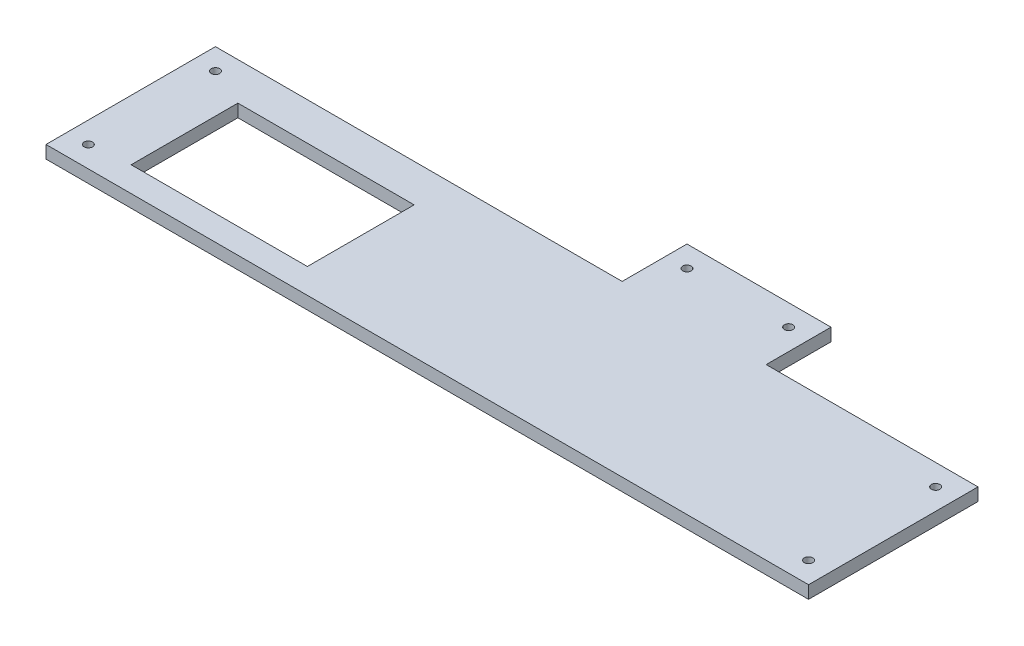
ISO-10303-21;
HEADER;
FILE_DESCRIPTION(('STEP AP214'),'2;1');
FILE_NAME('part.step','',(''),(''),'','','');
FILE_SCHEMA(('AUTOMOTIVE_DESIGN { 1 0 10303 214 1 1 1 1 }'));
ENDSEC;
DATA;
#1=APPLICATION_CONTEXT('core data for automotive mechanical design processes');
#2=APPLICATION_PROTOCOL_DEFINITION('international standard','automotive_design',2000,#1);
#3=PRODUCT_CONTEXT('',#1,'mechanical');
#4=PRODUCT('Part','Part','',(#3));
#5=PRODUCT_RELATED_PRODUCT_CATEGORY('part','',(#4));
#6=PRODUCT_DEFINITION_FORMATION('','',#4);
#7=PRODUCT_DEFINITION_CONTEXT('part definition',#1,'design');
#8=PRODUCT_DEFINITION('design','',#6,#7);
#9=PRODUCT_DEFINITION_SHAPE('','',#8);
#10=(LENGTH_UNIT() NAMED_UNIT(*) SI_UNIT(.MILLI.,.METRE.));
#11=(NAMED_UNIT(*) PLANE_ANGLE_UNIT() SI_UNIT($,.RADIAN.));
#12=(NAMED_UNIT(*) SI_UNIT($,.STERADIAN.) SOLID_ANGLE_UNIT());
#13=UNCERTAINTY_MEASURE_WITH_UNIT(LENGTH_MEASURE(1.E-05),#10,'distance_accuracy_value','');
#14=(GEOMETRIC_REPRESENTATION_CONTEXT(3) GLOBAL_UNCERTAINTY_ASSIGNED_CONTEXT((#13)) GLOBAL_UNIT_ASSIGNED_CONTEXT((#10,
#11,#12)) REPRESENTATION_CONTEXT('',''));
#15=CARTESIAN_POINT('',(0.,0.,0.));
#16=DIRECTION('',(0.,0.,1.));
#17=DIRECTION('',(1.,0.,0.));
#18=AXIS2_PLACEMENT_3D('',#15,#16,#17);
#19=CARTESIAN_POINT('',(450.,-15.,-100.000000000001));
#20=DIRECTION('',(0.,0.,-1.));
#21=DIRECTION('',(-1.,0.,0.));
#22=AXIS2_PLACEMENT_3D('',#19,#20,#21);
#23=PLANE('',#22);
#24=DIRECTION('',(-1.,0.,0.));
#25=VECTOR('',#24,1.);
#26=CARTESIAN_POINT('',(450.,-15.,-100.000000000001));
#27=LINE('',#26,#25);
#28=CARTESIAN_POINT('',(450.,-15.,-100.000000000001));
#29=VERTEX_POINT('',#28);
#30=CARTESIAN_POINT('',(200.,-15.,-100.000000000001));
#31=VERTEX_POINT('',#30);
#32=EDGE_CURVE('E223',#29,#31,#27,.T.);
#33=ORIENTED_EDGE('',*,*,#32,.T.);
#34=DIRECTION('',(0.,1.,0.));
#35=VECTOR('',#34,1.);
#36=CARTESIAN_POINT('',(200.,-15.,-100.000000000001));
#37=LINE('',#36,#35);
#38=CARTESIAN_POINT('',(200.,0.,-100.000000000001));
#39=VERTEX_POINT('',#38);
#40=EDGE_CURVE('E146',#31,#39,#37,.T.);
#41=ORIENTED_EDGE('',*,*,#40,.T.);
#42=DIRECTION('',(-1.,0.,0.));
#43=VECTOR('',#42,1.);
#44=CARTESIAN_POINT('',(450.,0.,-100.000000000001));
#45=LINE('',#44,#43);
#46=CARTESIAN_POINT('',(450.,0.,-100.000000000001));
#47=VERTEX_POINT('',#46);
#48=EDGE_CURVE('E234',#47,#39,#45,.T.);
#49=ORIENTED_EDGE('',*,*,#48,.F.);
#50=DIRECTION('',(0.,1.,0.));
#51=VECTOR('',#50,1.);
#52=CARTESIAN_POINT('',(450.,-15.,-100.000000000001));
#53=LINE('',#52,#51);
#54=EDGE_CURVE('E38',#29,#47,#53,.T.);
#55=ORIENTED_EDGE('',*,*,#54,.F.);
#56=EDGE_LOOP('',(#33,#41,#49,#55));
#57=FACE_BOUND('',#56,.T.);
#58=ADVANCED_FACE('F34',(#57),#23,.T.);
#59=CARTESIAN_POINT('',(450.,-15.,100.000000000001));
#60=DIRECTION('',(1.,0.,0.));
#61=DIRECTION('',(0.,0.,-1.));
#62=AXIS2_PLACEMENT_3D('',#59,#60,#61);
#63=PLANE('',#62);
#64=DIRECTION('',(0.,0.,-1.));
#65=VECTOR('',#64,1.);
#66=CARTESIAN_POINT('',(450.,0.,100.000000000001));
#67=LINE('',#66,#65);
#68=CARTESIAN_POINT('',(450.,0.,100.000000000001));
#69=VERTEX_POINT('',#68);
#70=EDGE_CURVE('E215',#69,#47,#67,.T.);
#71=ORIENTED_EDGE('',*,*,#70,.F.);
#72=DIRECTION('',(0.,1.,0.));
#73=VECTOR('',#72,1.);
#74=CARTESIAN_POINT('',(450.,-15.,100.000000000001));
#75=LINE('',#74,#73);
#76=CARTESIAN_POINT('',(450.,-15.,100.000000000001));
#77=VERTEX_POINT('',#76);
#78=EDGE_CURVE('E11',#77,#69,#75,.T.);
#79=ORIENTED_EDGE('',*,*,#78,.F.);
#80=DIRECTION('',(0.,0.,-1.));
#81=VECTOR('',#80,1.);
#82=CARTESIAN_POINT('',(450.,-15.,100.000000000001));
#83=LINE('',#82,#81);
#84=EDGE_CURVE('E218',#77,#29,#83,.T.);
#85=ORIENTED_EDGE('',*,*,#84,.T.);
#86=ORIENTED_EDGE('',*,*,#54,.T.);
#87=EDGE_LOOP('',(#71,#79,#85,#86));
#88=FACE_BOUND('',#87,.T.);
#89=ADVANCED_FACE('F36',(#88),#63,.T.);
#90=CARTESIAN_POINT('',(-450.,-15.,100.000000000001));
#91=DIRECTION('',(0.,0.,1.));
#92=DIRECTION('',(1.,0.,0.));
#93=AXIS2_PLACEMENT_3D('',#90,#91,#92);
#94=PLANE('',#93);
#95=DIRECTION('',(1.,0.,0.));
#96=VECTOR('',#95,1.);
#97=CARTESIAN_POINT('',(-450.,0.,100.000000000001));
#98=LINE('',#97,#96);
#99=CARTESIAN_POINT('',(-450.,0.,100.000000000001));
#100=VERTEX_POINT('',#99);
#101=EDGE_CURVE('E222',#100,#69,#98,.T.);
#102=ORIENTED_EDGE('',*,*,#101,.F.);
#103=DIRECTION('',(0.,1.,0.));
#104=VECTOR('',#103,1.);
#105=CARTESIAN_POINT('',(-450.,-15.,100.000000000001));
#106=LINE('',#105,#104);
#107=CARTESIAN_POINT('',(-450.,-15.,100.000000000001));
#108=VERTEX_POINT('',#107);
#109=EDGE_CURVE('E43',#108,#100,#106,.T.);
#110=ORIENTED_EDGE('',*,*,#109,.F.);
#111=DIRECTION('',(1.,0.,0.));
#112=VECTOR('',#111,1.);
#113=CARTESIAN_POINT('',(-450.,-15.,100.000000000001));
#114=LINE('',#113,#112);
#115=EDGE_CURVE('E228',#108,#77,#114,.T.);
#116=ORIENTED_EDGE('',*,*,#115,.T.);
#117=ORIENTED_EDGE('',*,*,#78,.T.);
#118=EDGE_LOOP('',(#102,#110,#116,#117));
#119=FACE_BOUND('',#118,.T.);
#120=ADVANCED_FACE('F257',(#119),#94,.T.);
#121=CARTESIAN_POINT('',(-450.,-15.,-100.));
#122=DIRECTION('',(-1.,0.,0.));
#123=DIRECTION('',(0.,0.,1.));
#124=AXIS2_PLACEMENT_3D('',#121,#122,#123);
#125=PLANE('',#124);
#126=DIRECTION('',(0.,0.,1.));
#127=VECTOR('',#126,1.);
#128=CARTESIAN_POINT('',(-450.,0.,-100.));
#129=LINE('',#128,#127);
#130=CARTESIAN_POINT('',(-450.,0.,-100.));
#131=VERTEX_POINT('',#130);
#132=EDGE_CURVE('E237',#131,#100,#129,.T.);
#133=ORIENTED_EDGE('',*,*,#132,.F.);
#134=DIRECTION('',(0.,1.,0.));
#135=VECTOR('',#134,1.);
#136=CARTESIAN_POINT('',(-450.,-15.,-100.));
#137=LINE('',#136,#135);
#138=CARTESIAN_POINT('',(-450.,-15.,-100.));
#139=VERTEX_POINT('',#138);
#140=EDGE_CURVE('E242',#139,#131,#137,.T.);
#141=ORIENTED_EDGE('',*,*,#140,.F.);
#142=DIRECTION('',(0.,0.,1.));
#143=VECTOR('',#142,1.);
#144=CARTESIAN_POINT('',(-450.,-15.,-100.));
#145=LINE('',#144,#143);
#146=EDGE_CURVE('E225',#139,#108,#145,.T.);
#147=ORIENTED_EDGE('',*,*,#146,.T.);
#148=ORIENTED_EDGE('',*,*,#109,.T.);
#149=EDGE_LOOP('',(#133,#141,#147,#148));
#150=FACE_BOUND('',#149,.T.);
#151=ADVANCED_FACE('F261',(#150),#125,.T.);
#152=DIRECTION('',(0.,1.,0.));
#153=VECTOR('',#152,1.);
#154=CARTESIAN_POINT('',(30.,-15.,-100.000000000001));
#155=LINE('',#154,#153);
#156=CARTESIAN_POINT('',(30.,-15.,-100.000000000001));
#157=VERTEX_POINT('',#156);
#158=CARTESIAN_POINT('',(30.,0.,-100.000000000001));
#159=VERTEX_POINT('',#158);
#160=EDGE_CURVE('E160',#157,#159,#155,.T.);
#161=ORIENTED_EDGE('',*,*,#160,.F.);
#162=EDGE_CURVE('E221',#157,#139,#27,.T.);
#163=ORIENTED_EDGE('',*,*,#162,.T.);
#164=ORIENTED_EDGE('',*,*,#140,.T.);
#165=EDGE_CURVE('E233',#159,#131,#45,.T.);
#166=ORIENTED_EDGE('',*,*,#165,.F.);
#167=EDGE_LOOP('',(#161,#163,#164,#166));
#168=FACE_BOUND('',#167,.T.);
#169=ADVANCED_FACE('F263',(#168),#23,.T.);
#170=CARTESIAN_POINT('',(0.,-15.,0.));
#171=DIRECTION('',(0.,1.,0.));
#172=DIRECTION('',(0.,0.,1.));
#173=AXIS2_PLACEMENT_3D('',#170,#171,#172);
#174=PLANE('',#173);
#175=DIRECTION('',(1.,0.,0.));
#176=VECTOR('',#175,1.);
#177=CARTESIAN_POINT('',(-379.,-15.,-55.5));
#178=LINE('',#177,#176);
#179=CARTESIAN_POINT('',(-379.,-15.,-55.5));
#180=VERTEX_POINT('',#179);
#181=CARTESIAN_POINT('',(-171.,-15.,-55.5));
#182=VERTEX_POINT('',#181);
#183=EDGE_CURVE('E178',#180,#182,#178,.T.);
#184=ORIENTED_EDGE('',*,*,#183,.F.);
#185=DIRECTION('',(0.,0.,-1.));
#186=VECTOR('',#185,1.);
#187=CARTESIAN_POINT('',(-379.,-15.,70.5000000000002));
#188=LINE('',#187,#186);
#189=CARTESIAN_POINT('',(-379.,-15.,70.5000000000002));
#190=VERTEX_POINT('',#189);
#191=EDGE_CURVE('E59',#190,#180,#188,.T.);
#192=ORIENTED_EDGE('',*,*,#191,.F.);
#193=DIRECTION('',(-1.,0.,0.));
#194=VECTOR('',#193,1.);
#195=CARTESIAN_POINT('',(-379.,-15.,70.5000000000002));
#196=LINE('',#195,#194);
#197=CARTESIAN_POINT('',(-171.,-15.,70.5000000000002));
#198=VERTEX_POINT('',#197);
#199=EDGE_CURVE('E167',#198,#190,#196,.T.);
#200=ORIENTED_EDGE('',*,*,#199,.F.);
#201=DIRECTION('',(0.,0.,1.));
#202=VECTOR('',#201,1.);
#203=CARTESIAN_POINT('',(-171.,-15.,70.5000000000002));
#204=LINE('',#203,#202);
#205=EDGE_CURVE('E181',#182,#198,#204,.T.);
#206=ORIENTED_EDGE('',*,*,#205,.F.);
#207=EDGE_LOOP('',(#184,#192,#200,#206));
#208=FACE_BOUND('',#207,.T.);
#209=CARTESIAN_POINT('',(-425.,-15.,-75.0000000000004));
#210=DIRECTION('',(0.,1.,0.));
#211=DIRECTION('',(0.,0.,1.));
#212=AXIS2_PLACEMENT_3D('',#209,#210,#211);
#213=CIRCLE('',#212,4.99999999999999);
#214=CARTESIAN_POINT('',(-425.,-15.,-70.0000000000004));
#215=VERTEX_POINT('',#214);
#216=EDGE_CURVE('E194',#215,#215,#213,.T.);
#217=ORIENTED_EDGE('',*,*,#216,.T.);
#218=EDGE_LOOP('',(#217));
#219=FACE_BOUND('',#218,.T.);
#220=CARTESIAN_POINT('',(-425.,-15.,75.000000000001));
#221=DIRECTION('',(0.,1.,0.));
#222=DIRECTION('',(0.,0.,1.));
#223=AXIS2_PLACEMENT_3D('',#220,#221,#222);
#224=CIRCLE('',#223,4.99999999999999);
#225=CARTESIAN_POINT('',(-425.,-15.,80.000000000001));
#226=VERTEX_POINT('',#225);
#227=EDGE_CURVE('E200',#226,#226,#224,.T.);
#228=ORIENTED_EDGE('',*,*,#227,.T.);
#229=EDGE_LOOP('',(#228));
#230=FACE_BOUND('',#229,.T.);
#231=CARTESIAN_POINT('',(425.,-15.,-75.000000000001));
#232=DIRECTION('',(0.,1.,0.));
#233=DIRECTION('',(0.,0.,1.));
#234=AXIS2_PLACEMENT_3D('',#231,#232,#233);
#235=CIRCLE('',#234,4.99999999999999);
#236=CARTESIAN_POINT('',(425.,-15.,-70.000000000001));
#237=VERTEX_POINT('',#236);
#238=EDGE_CURVE('E206',#237,#237,#235,.T.);
#239=ORIENTED_EDGE('',*,*,#238,.T.);
#240=EDGE_LOOP('',(#239));
#241=FACE_BOUND('',#240,.T.);
#242=CARTESIAN_POINT('',(425.,-15.,75.000000000001));
#243=DIRECTION('',(0.,1.,0.));
#244=DIRECTION('',(0.,0.,1.));
#245=AXIS2_PLACEMENT_3D('',#242,#243,#244);
#246=CIRCLE('',#245,4.99999999999999);
#247=CARTESIAN_POINT('',(425.,-15.,80.000000000001));
#248=VERTEX_POINT('',#247);
#249=EDGE_CURVE('E212',#248,#248,#246,.T.);
#250=ORIENTED_EDGE('',*,*,#249,.T.);
#251=EDGE_LOOP('',(#250));
#252=FACE_BOUND('',#251,.T.);
#253=ORIENTED_EDGE('',*,*,#84,.F.);
#254=ORIENTED_EDGE('',*,*,#115,.F.);
#255=ORIENTED_EDGE('',*,*,#146,.F.);
#256=ORIENTED_EDGE('',*,*,#162,.F.);
#257=DIRECTION('',(0.,0.,1.));
#258=VECTOR('',#257,1.);
#259=CARTESIAN_POINT('',(30.,-15.,-100.000000000001));
#260=LINE('',#259,#258);
#261=CARTESIAN_POINT('',(30.,-15.,-176.5));
#262=VERTEX_POINT('',#261);
#263=EDGE_CURVE('E132',#262,#157,#260,.T.);
#264=ORIENTED_EDGE('',*,*,#263,.F.);
#265=DIRECTION('',(-1.,0.,0.));
#266=VECTOR('',#265,1.);
#267=CARTESIAN_POINT('',(200.,-15.,-176.5));
#268=LINE('',#267,#266);
#269=CARTESIAN_POINT('',(200.,-15.,-176.5));
#270=VERTEX_POINT('',#269);
#271=EDGE_CURVE('E127',#270,#262,#268,.T.);
#272=ORIENTED_EDGE('',*,*,#271,.F.);
#273=DIRECTION('',(0.,0.,-1.));
#274=VECTOR('',#273,1.);
#275=CARTESIAN_POINT('',(200.,-15.,-100.000000000001));
#276=LINE('',#275,#274);
#277=EDGE_CURVE('E141',#31,#270,#276,.T.);
#278=ORIENTED_EDGE('',*,*,#277,.F.);
#279=ORIENTED_EDGE('',*,*,#32,.F.);
#280=EDGE_LOOP('',(#253,#254,#255,#256,#264,#272,#278,#279));
#281=FACE_BOUND('',#280,.T.);
#282=CARTESIAN_POINT('',(54.9999999999999,-15.,-151.5));
#283=DIRECTION('',(0.,1.,0.));
#284=DIRECTION('',(0.,0.,-1.));
#285=AXIS2_PLACEMENT_3D('',#282,#283,#284);
#286=CIRCLE('',#285,4.99999999999999);
#287=CARTESIAN_POINT('',(54.9999999999999,-15.,-156.5));
#288=VERTEX_POINT('',#287);
#289=EDGE_CURVE('E446',#288,#288,#286,.T.);
#290=ORIENTED_EDGE('',*,*,#289,.T.);
#291=EDGE_LOOP('',(#290));
#292=FACE_BOUND('',#291,.T.);
#293=CARTESIAN_POINT('',(175.,-15.,-151.5));
#294=DIRECTION('',(0.,1.,0.));
#295=DIRECTION('',(0.,0.,1.));
#296=AXIS2_PLACEMENT_3D('',#293,#294,#295);
#297=CIRCLE('',#296,4.99999999999999);
#298=CARTESIAN_POINT('',(175.,-15.,-146.5));
#299=VERTEX_POINT('',#298);
#300=EDGE_CURVE('E157',#299,#299,#297,.T.);
#301=ORIENTED_EDGE('',*,*,#300,.T.);
#302=EDGE_LOOP('',(#301));
#303=FACE_BOUND('',#302,.T.);
#304=ADVANCED_FACE('F138',(#208,#219,#230,#241,#252,#281,#292,#303),#174,.F.);
#305=CARTESIAN_POINT('',(0.,0.,0.));
#306=DIRECTION('',(0.,1.,0.));
#307=DIRECTION('',(0.,0.,1.));
#308=AXIS2_PLACEMENT_3D('',#305,#306,#307);
#309=PLANE('',#308);
#310=DIRECTION('',(0.,0.,-1.));
#311=VECTOR('',#310,1.);
#312=CARTESIAN_POINT('',(-379.,0.,70.5000000000002));
#313=LINE('',#312,#311);
#314=CARTESIAN_POINT('',(-379.,0.,70.5000000000002));
#315=VERTEX_POINT('',#314);
#316=CARTESIAN_POINT('',(-379.,0.,-55.5));
#317=VERTEX_POINT('',#316);
#318=EDGE_CURVE('E163',#315,#317,#313,.T.);
#319=ORIENTED_EDGE('',*,*,#318,.T.);
#320=DIRECTION('',(1.,0.,0.));
#321=VECTOR('',#320,1.);
#322=CARTESIAN_POINT('',(-379.,0.,-55.5));
#323=LINE('',#322,#321);
#324=CARTESIAN_POINT('',(-171.,0.,-55.5));
#325=VERTEX_POINT('',#324);
#326=EDGE_CURVE('E166',#317,#325,#323,.T.);
#327=ORIENTED_EDGE('',*,*,#326,.T.);
#328=DIRECTION('',(0.,0.,1.));
#329=VECTOR('',#328,1.);
#330=CARTESIAN_POINT('',(-171.,0.,70.5000000000002));
#331=LINE('',#330,#329);
#332=CARTESIAN_POINT('',(-171.,0.,70.5000000000002));
#333=VERTEX_POINT('',#332);
#334=EDGE_CURVE('E170',#325,#333,#331,.T.);
#335=ORIENTED_EDGE('',*,*,#334,.T.);
#336=DIRECTION('',(-1.,0.,0.));
#337=VECTOR('',#336,1.);
#338=CARTESIAN_POINT('',(-379.,0.,70.5000000000002));
#339=LINE('',#338,#337);
#340=EDGE_CURVE('E173',#333,#315,#339,.T.);
#341=ORIENTED_EDGE('',*,*,#340,.T.);
#342=EDGE_LOOP('',(#319,#327,#335,#341));
#343=FACE_BOUND('',#342,.T.);
#344=CARTESIAN_POINT('',(-425.,0.,-75.0000000000004));
#345=DIRECTION('',(0.,1.,0.));
#346=DIRECTION('',(0.,0.,1.));
#347=AXIS2_PLACEMENT_3D('',#344,#345,#346);
#348=CIRCLE('',#347,4.99999999999999);
#349=CARTESIAN_POINT('',(-425.,0.,-70.0000000000004));
#350=VERTEX_POINT('',#349);
#351=EDGE_CURVE('E188',#350,#350,#348,.T.);
#352=ORIENTED_EDGE('',*,*,#351,.F.);
#353=EDGE_LOOP('',(#352));
#354=FACE_BOUND('',#353,.T.);
#355=CARTESIAN_POINT('',(-425.,0.,75.000000000001));
#356=DIRECTION('',(0.,1.,0.));
#357=DIRECTION('',(0.,0.,1.));
#358=AXIS2_PLACEMENT_3D('',#355,#356,#357);
#359=CIRCLE('',#358,4.99999999999999);
#360=CARTESIAN_POINT('',(-425.,0.,80.000000000001));
#361=VERTEX_POINT('',#360);
#362=EDGE_CURVE('E197',#361,#361,#359,.T.);
#363=ORIENTED_EDGE('',*,*,#362,.F.);
#364=EDGE_LOOP('',(#363));
#365=FACE_BOUND('',#364,.T.);
#366=CARTESIAN_POINT('',(425.,0.,-75.000000000001));
#367=DIRECTION('',(0.,1.,0.));
#368=DIRECTION('',(0.,0.,1.));
#369=AXIS2_PLACEMENT_3D('',#366,#367,#368);
#370=CIRCLE('',#369,4.99999999999999);
#371=CARTESIAN_POINT('',(425.,0.,-70.000000000001));
#372=VERTEX_POINT('',#371);
#373=EDGE_CURVE('E203',#372,#372,#370,.T.);
#374=ORIENTED_EDGE('',*,*,#373,.F.);
#375=EDGE_LOOP('',(#374));
#376=FACE_BOUND('',#375,.T.);
#377=CARTESIAN_POINT('',(425.,0.,75.000000000001));
#378=DIRECTION('',(0.,1.,0.));
#379=DIRECTION('',(0.,0.,1.));
#380=AXIS2_PLACEMENT_3D('',#377,#378,#379);
#381=CIRCLE('',#380,4.99999999999999);
#382=CARTESIAN_POINT('',(425.,0.,80.000000000001));
#383=VERTEX_POINT('',#382);
#384=EDGE_CURVE('E209',#383,#383,#381,.T.);
#385=ORIENTED_EDGE('',*,*,#384,.F.);
#386=EDGE_LOOP('',(#385));
#387=FACE_BOUND('',#386,.T.);
#388=ORIENTED_EDGE('',*,*,#70,.T.);
#389=ORIENTED_EDGE('',*,*,#48,.T.);
#390=DIRECTION('',(0.,0.,-1.));
#391=VECTOR('',#390,1.);
#392=CARTESIAN_POINT('',(200.,0.,-100.000000000001));
#393=LINE('',#392,#391);
#394=CARTESIAN_POINT('',(200.,0.,-176.5));
#395=VERTEX_POINT('',#394);
#396=EDGE_CURVE('E51',#39,#395,#393,.T.);
#397=ORIENTED_EDGE('',*,*,#396,.T.);
#398=DIRECTION('',(-1.,0.,0.));
#399=VECTOR('',#398,1.);
#400=CARTESIAN_POINT('',(200.,0.,-176.5));
#401=LINE('',#400,#399);
#402=CARTESIAN_POINT('',(30.,0.,-176.5));
#403=VERTEX_POINT('',#402);
#404=EDGE_CURVE('E129',#395,#403,#401,.T.);
#405=ORIENTED_EDGE('',*,*,#404,.T.);
#406=DIRECTION('',(0.,0.,1.));
#407=VECTOR('',#406,1.);
#408=CARTESIAN_POINT('',(30.,0.,-100.000000000001));
#409=LINE('',#408,#407);
#410=EDGE_CURVE('E147',#403,#159,#409,.T.);
#411=ORIENTED_EDGE('',*,*,#410,.T.);
#412=ORIENTED_EDGE('',*,*,#165,.T.);
#413=ORIENTED_EDGE('',*,*,#132,.T.);
#414=ORIENTED_EDGE('',*,*,#101,.T.);
#415=EDGE_LOOP('',(#388,#389,#397,#405,#411,#412,#413,#414));
#416=FACE_BOUND('',#415,.T.);
#417=CARTESIAN_POINT('',(54.9999999999999,0.,-151.5));
#418=DIRECTION('',(0.,1.,0.));
#419=DIRECTION('',(0.,0.,-1.));
#420=AXIS2_PLACEMENT_3D('',#417,#418,#419);
#421=CIRCLE('',#420,4.99999999999999);
#422=CARTESIAN_POINT('',(54.9999999999999,0.,-156.5));
#423=VERTEX_POINT('',#422);
#424=EDGE_CURVE('E449',#423,#423,#421,.T.);
#425=ORIENTED_EDGE('',*,*,#424,.F.);
#426=EDGE_LOOP('',(#425));
#427=FACE_BOUND('',#426,.T.);
#428=CARTESIAN_POINT('',(175.,0.,-151.5));
#429=DIRECTION('',(0.,1.,0.));
#430=DIRECTION('',(0.,0.,1.));
#431=AXIS2_PLACEMENT_3D('',#428,#429,#430);
#432=CIRCLE('',#431,4.99999999999999);
#433=CARTESIAN_POINT('',(175.,0.,-146.5));
#434=VERTEX_POINT('',#433);
#435=EDGE_CURVE('E152',#434,#434,#432,.T.);
#436=ORIENTED_EDGE('',*,*,#435,.F.);
#437=EDGE_LOOP('',(#436));
#438=FACE_BOUND('',#437,.T.);
#439=ADVANCED_FACE('F253',(#343,#354,#365,#376,#387,#416,#427,#438),#309,.T.);
#440=CARTESIAN_POINT('',(425.,-15.,75.000000000001));
#441=DIRECTION('',(0.,1.,0.));
#442=DIRECTION('',(0.,0.,1.));
#443=AXIS2_PLACEMENT_3D('',#440,#441,#442);
#444=CYLINDRICAL_SURFACE('',#443,4.99999999999999);
#445=ORIENTED_EDGE('',*,*,#249,.F.);
#446=EDGE_LOOP('',(#445));
#447=FACE_BOUND('',#446,.T.);
#448=ORIENTED_EDGE('',*,*,#384,.T.);
#449=EDGE_LOOP('',(#448));
#450=FACE_BOUND('',#449,.T.);
#451=ADVANCED_FACE('F290',(#447,#450),#444,.F.);
#452=CARTESIAN_POINT('',(425.,-15.,-75.000000000001));
#453=DIRECTION('',(0.,1.,0.));
#454=DIRECTION('',(0.,0.,1.));
#455=AXIS2_PLACEMENT_3D('',#452,#453,#454);
#456=CYLINDRICAL_SURFACE('',#455,4.99999999999999);
#457=ORIENTED_EDGE('',*,*,#238,.F.);
#458=EDGE_LOOP('',(#457));
#459=FACE_BOUND('',#458,.T.);
#460=ORIENTED_EDGE('',*,*,#373,.T.);
#461=EDGE_LOOP('',(#460));
#462=FACE_BOUND('',#461,.T.);
#463=ADVANCED_FACE('F295',(#459,#462),#456,.F.);
#464=CARTESIAN_POINT('',(-425.,-15.,75.000000000001));
#465=DIRECTION('',(0.,1.,0.));
#466=DIRECTION('',(0.,0.,1.));
#467=AXIS2_PLACEMENT_3D('',#464,#465,#466);
#468=CYLINDRICAL_SURFACE('',#467,4.99999999999999);
#469=ORIENTED_EDGE('',*,*,#227,.F.);
#470=EDGE_LOOP('',(#469));
#471=FACE_BOUND('',#470,.T.);
#472=ORIENTED_EDGE('',*,*,#362,.T.);
#473=EDGE_LOOP('',(#472));
#474=FACE_BOUND('',#473,.T.);
#475=ADVANCED_FACE('F307',(#471,#474),#468,.F.);
#476=CARTESIAN_POINT('',(-425.,-15.,-75.0000000000004));
#477=DIRECTION('',(0.,1.,0.));
#478=DIRECTION('',(0.,0.,1.));
#479=AXIS2_PLACEMENT_3D('',#476,#477,#478);
#480=CYLINDRICAL_SURFACE('',#479,4.99999999999999);
#481=ORIENTED_EDGE('',*,*,#216,.F.);
#482=EDGE_LOOP('',(#481));
#483=FACE_BOUND('',#482,.T.);
#484=ORIENTED_EDGE('',*,*,#351,.T.);
#485=EDGE_LOOP('',(#484));
#486=FACE_BOUND('',#485,.T.);
#487=ADVANCED_FACE('F317',(#483,#486),#480,.F.);
#488=CARTESIAN_POINT('',(-379.,0.,70.5000000000002));
#489=DIRECTION('',(-1.,0.,0.));
#490=DIRECTION('',(0.,0.,1.));
#491=AXIS2_PLACEMENT_3D('',#488,#489,#490);
#492=PLANE('',#491);
#493=ORIENTED_EDGE('',*,*,#191,.T.);
#494=DIRECTION('',(0.,-1.,0.));
#495=VECTOR('',#494,1.);
#496=CARTESIAN_POINT('',(-379.,0.,-55.5));
#497=LINE('',#496,#495);
#498=EDGE_CURVE('E176',#317,#180,#497,.T.);
#499=ORIENTED_EDGE('',*,*,#498,.F.);
#500=ORIENTED_EDGE('',*,*,#318,.F.);
#501=DIRECTION('',(0.,-1.,0.));
#502=VECTOR('',#501,1.);
#503=CARTESIAN_POINT('',(-379.,0.,70.5000000000002));
#504=LINE('',#503,#502);
#505=EDGE_CURVE('E186',#315,#190,#504,.T.);
#506=ORIENTED_EDGE('',*,*,#505,.T.);
#507=EDGE_LOOP('',(#493,#499,#500,#506));
#508=FACE_BOUND('',#507,.T.);
#509=ADVANCED_FACE('F327',(#508),#492,.F.);
#510=CARTESIAN_POINT('',(-379.,0.,70.5000000000002));
#511=DIRECTION('',(0.,0.,1.));
#512=DIRECTION('',(1.,0.,0.));
#513=AXIS2_PLACEMENT_3D('',#510,#511,#512);
#514=PLANE('',#513);
#515=ORIENTED_EDGE('',*,*,#199,.T.);
#516=ORIENTED_EDGE('',*,*,#505,.F.);
#517=ORIENTED_EDGE('',*,*,#340,.F.);
#518=DIRECTION('',(0.,-1.,0.));
#519=VECTOR('',#518,1.);
#520=CARTESIAN_POINT('',(-171.,0.,70.5000000000002));
#521=LINE('',#520,#519);
#522=EDGE_CURVE('E189',#333,#198,#521,.T.);
#523=ORIENTED_EDGE('',*,*,#522,.T.);
#524=EDGE_LOOP('',(#515,#516,#517,#523));
#525=FACE_BOUND('',#524,.T.);
#526=ADVANCED_FACE('F337',(#525),#514,.F.);
#527=CARTESIAN_POINT('',(-171.,0.,70.5000000000002));
#528=DIRECTION('',(1.,0.,0.));
#529=DIRECTION('',(0.,0.,-1.));
#530=AXIS2_PLACEMENT_3D('',#527,#528,#529);
#531=PLANE('',#530);
#532=ORIENTED_EDGE('',*,*,#205,.T.);
#533=ORIENTED_EDGE('',*,*,#522,.F.);
#534=ORIENTED_EDGE('',*,*,#334,.F.);
#535=DIRECTION('',(0.,-1.,0.));
#536=VECTOR('',#535,1.);
#537=CARTESIAN_POINT('',(-171.,0.,-55.5));
#538=LINE('',#537,#536);
#539=EDGE_CURVE('E191',#325,#182,#538,.T.);
#540=ORIENTED_EDGE('',*,*,#539,.T.);
#541=EDGE_LOOP('',(#532,#533,#534,#540));
#542=FACE_BOUND('',#541,.T.);
#543=ADVANCED_FACE('F346',(#542),#531,.F.);
#544=CARTESIAN_POINT('',(-379.,0.,-55.5));
#545=DIRECTION('',(0.,0.,-1.));
#546=DIRECTION('',(-1.,0.,0.));
#547=AXIS2_PLACEMENT_3D('',#544,#545,#546);
#548=PLANE('',#547);
#549=ORIENTED_EDGE('',*,*,#183,.T.);
#550=ORIENTED_EDGE('',*,*,#539,.F.);
#551=ORIENTED_EDGE('',*,*,#326,.F.);
#552=ORIENTED_EDGE('',*,*,#498,.T.);
#553=EDGE_LOOP('',(#549,#550,#551,#552));
#554=FACE_BOUND('',#553,.T.);
#555=ADVANCED_FACE('F356',(#554),#548,.F.);
#556=CARTESIAN_POINT('',(200.,-15.,-100.000000000001));
#557=DIRECTION('',(1.,0.,0.));
#558=DIRECTION('',(0.,0.,-1.));
#559=AXIS2_PLACEMENT_3D('',#556,#557,#558);
#560=PLANE('',#559);
#561=ORIENTED_EDGE('',*,*,#396,.F.);
#562=ORIENTED_EDGE('',*,*,#40,.F.);
#563=ORIENTED_EDGE('',*,*,#277,.T.);
#564=DIRECTION('',(0.,1.,0.));
#565=VECTOR('',#564,1.);
#566=CARTESIAN_POINT('',(200.,-15.,-176.5));
#567=LINE('',#566,#565);
#568=EDGE_CURVE('E124',#270,#395,#567,.T.);
#569=ORIENTED_EDGE('',*,*,#568,.T.);
#570=EDGE_LOOP('',(#561,#562,#563,#569));
#571=FACE_BOUND('',#570,.T.);
#572=ADVANCED_FACE('F145',(#571),#560,.T.);
#573=CARTESIAN_POINT('',(30.,-15.,-100.000000000001));
#574=DIRECTION('',(-1.,0.,0.));
#575=DIRECTION('',(0.,0.,1.));
#576=AXIS2_PLACEMENT_3D('',#573,#574,#575);
#577=PLANE('',#576);
#578=ORIENTED_EDGE('',*,*,#410,.F.);
#579=DIRECTION('',(0.,1.,0.));
#580=VECTOR('',#579,1.);
#581=CARTESIAN_POINT('',(30.,-15.,-176.5));
#582=LINE('',#581,#580);
#583=EDGE_CURVE('E131',#262,#403,#582,.T.);
#584=ORIENTED_EDGE('',*,*,#583,.F.);
#585=ORIENTED_EDGE('',*,*,#263,.T.);
#586=ORIENTED_EDGE('',*,*,#160,.T.);
#587=EDGE_LOOP('',(#578,#584,#585,#586));
#588=FACE_BOUND('',#587,.T.);
#589=ADVANCED_FACE('F402',(#588),#577,.T.);
#590=CARTESIAN_POINT('',(200.,-15.,-176.5));
#591=DIRECTION('',(0.,0.,-1.));
#592=DIRECTION('',(-1.,0.,0.));
#593=AXIS2_PLACEMENT_3D('',#590,#591,#592);
#594=PLANE('',#593);
#595=ORIENTED_EDGE('',*,*,#404,.F.);
#596=ORIENTED_EDGE('',*,*,#568,.F.);
#597=ORIENTED_EDGE('',*,*,#271,.T.);
#598=ORIENTED_EDGE('',*,*,#583,.T.);
#599=EDGE_LOOP('',(#595,#596,#597,#598));
#600=FACE_BOUND('',#599,.T.);
#601=ADVANCED_FACE('F126',(#600),#594,.T.);
#602=CARTESIAN_POINT('',(175.,-15.,-151.5));
#603=DIRECTION('',(0.,1.,0.));
#604=DIRECTION('',(0.,0.,1.));
#605=AXIS2_PLACEMENT_3D('',#602,#603,#604);
#606=CYLINDRICAL_SURFACE('',#605,4.99999999999999);
#607=ORIENTED_EDGE('',*,*,#300,.F.);
#608=EDGE_LOOP('',(#607));
#609=FACE_BOUND('',#608,.T.);
#610=ORIENTED_EDGE('',*,*,#435,.T.);
#611=EDGE_LOOP('',(#610));
#612=FACE_BOUND('',#611,.T.);
#613=ADVANCED_FACE('F420',(#609,#612),#606,.F.);
#614=CARTESIAN_POINT('',(54.9999999999999,-15.,-151.5));
#615=DIRECTION('',(0.,1.,0.));
#616=DIRECTION('',(0.,0.,1.));
#617=AXIS2_PLACEMENT_3D('',#614,#615,#616);
#618=CYLINDRICAL_SURFACE('',#617,4.99999999999999);
#619=ORIENTED_EDGE('',*,*,#289,.F.);
#620=EDGE_LOOP('',(#619));
#621=FACE_BOUND('',#620,.T.);
#622=ORIENTED_EDGE('',*,*,#424,.T.);
#623=EDGE_LOOP('',(#622));
#624=FACE_BOUND('',#623,.T.);
#625=ADVANCED_FACE('F429',(#621,#624),#618,.F.);
#626=CLOSED_SHELL('',(#58,#89,#120,#151,#169,#304,#439,#451,#463,#475,#487,#509,#526,#543,#555,
#572,#589,#601,#613,#625));
#627=MANIFOLD_SOLID_BREP('B2',#626);
#628=ADVANCED_BREP_SHAPE_REPRESENTATION('',(#18,#627),#14);
#629=SHAPE_DEFINITION_REPRESENTATION(#9,#628);
ENDSEC;
END-ISO-10303-21;
